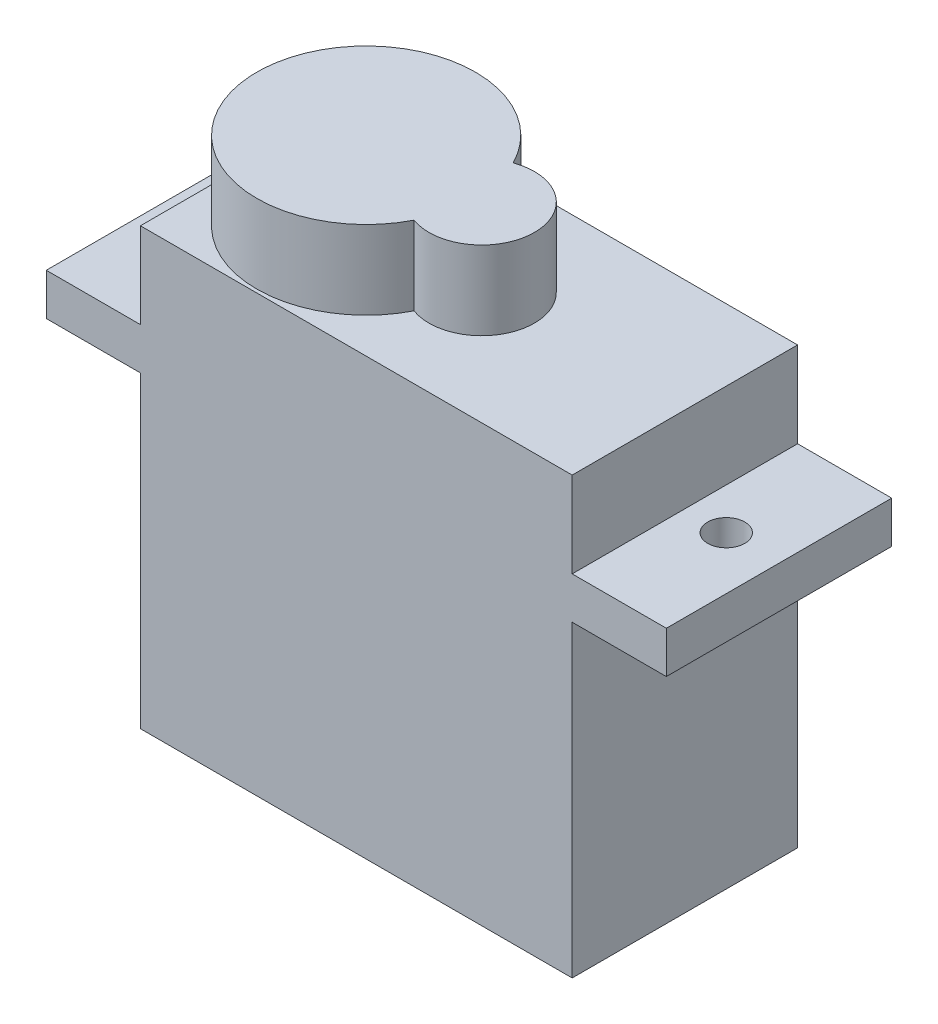
ISO-10303-21;
HEADER;
FILE_DESCRIPTION(('STEP AP214'),'2;1');
FILE_NAME('part.step','',(''),(''),'','','');
FILE_SCHEMA(('AUTOMOTIVE_DESIGN { 1 0 10303 214 1 1 1 1 }'));
ENDSEC;
DATA;
#1=APPLICATION_CONTEXT('core data for automotive mechanical design processes');
#2=APPLICATION_PROTOCOL_DEFINITION('international standard','automotive_design',2000,#1);
#3=PRODUCT_CONTEXT('',#1,'mechanical');
#4=PRODUCT('Part','Part','',(#3));
#5=PRODUCT_RELATED_PRODUCT_CATEGORY('part','',(#4));
#6=PRODUCT_DEFINITION_FORMATION('','',#4);
#7=PRODUCT_DEFINITION_CONTEXT('part definition',#1,'design');
#8=PRODUCT_DEFINITION('design','',#6,#7);
#9=PRODUCT_DEFINITION_SHAPE('','',#8);
#10=(LENGTH_UNIT() NAMED_UNIT(*) SI_UNIT(.MILLI.,.METRE.));
#11=(NAMED_UNIT(*) PLANE_ANGLE_UNIT() SI_UNIT($,.RADIAN.));
#12=(NAMED_UNIT(*) SI_UNIT($,.STERADIAN.) SOLID_ANGLE_UNIT());
#13=UNCERTAINTY_MEASURE_WITH_UNIT(LENGTH_MEASURE(1.E-05),#10,'distance_accuracy_value','');
#14=(GEOMETRIC_REPRESENTATION_CONTEXT(3) GLOBAL_UNCERTAINTY_ASSIGNED_CONTEXT((#13)) GLOBAL_UNIT_ASSIGNED_CONTEXT((#10,
#11,#12)) REPRESENTATION_CONTEXT('',''));
#15=CARTESIAN_POINT('',(0.,0.,0.));
#16=DIRECTION('',(0.,0.,1.));
#17=DIRECTION('',(1.,0.,0.));
#18=AXIS2_PLACEMENT_3D('',#15,#16,#17);
#19=CARTESIAN_POINT('',(0.,6.7,0.));
#20=DIRECTION('',(0.,-1.,0.));
#21=DIRECTION('',(0.,0.,-1.));
#22=AXIS2_PLACEMENT_3D('',#19,#20,#21);
#23=PLANE('',#22);
#24=DIRECTION('',(0.,0.,-1.));
#25=VECTOR('',#24,1.);
#26=CARTESIAN_POINT('',(11.35,6.7,5.925));
#27=LINE('',#26,#25);
#28=CARTESIAN_POINT('',(11.35,6.7,5.925));
#29=VERTEX_POINT('',#28);
#30=CARTESIAN_POINT('',(11.35,6.7,-5.925));
#31=VERTEX_POINT('',#30);
#32=EDGE_CURVE('E168',#29,#31,#27,.T.);
#33=ORIENTED_EDGE('',*,*,#32,.T.);
#34=DIRECTION('',(-1.,0.,0.));
#35=VECTOR('',#34,1.);
#36=CARTESIAN_POINT('',(-11.35,6.7,-5.925));
#37=LINE('',#36,#35);
#38=CARTESIAN_POINT('',(-11.35,6.7,-5.925));
#39=VERTEX_POINT('',#38);
#40=EDGE_CURVE('E171',#31,#39,#37,.T.);
#41=ORIENTED_EDGE('',*,*,#40,.T.);
#42=DIRECTION('',(0.,0.,1.));
#43=VECTOR('',#42,1.);
#44=CARTESIAN_POINT('',(-11.35,6.7,5.925));
#45=LINE('',#44,#43);
#46=CARTESIAN_POINT('',(-11.35,6.7,5.925));
#47=VERTEX_POINT('',#46);
#48=EDGE_CURVE('E174',#39,#47,#45,.T.);
#49=ORIENTED_EDGE('',*,*,#48,.T.);
#50=DIRECTION('',(1.,0.,0.));
#51=VECTOR('',#50,1.);
#52=CARTESIAN_POINT('',(-11.35,6.7,5.925));
#53=LINE('',#52,#51);
#54=EDGE_CURVE('E177',#47,#29,#53,.T.);
#55=ORIENTED_EDGE('',*,*,#54,.T.);
#56=EDGE_LOOP('',(#33,#41,#49,#55));
#57=FACE_BOUND('',#56,.T.);
#58=CARTESIAN_POINT('',(-5.40813132000409,6.7,0.));
#59=DIRECTION('',(0.,1.,0.));
#60=DIRECTION('',(0.,0.,1.));
#61=AXIS2_PLACEMENT_3D('',#58,#59,#60);
#62=CIRCLE('',#61,5.75);
#63=CARTESIAN_POINT('',(-0.283234200662525,6.7,-2.6072839347038));
#64=VERTEX_POINT('',#63);
#65=CARTESIAN_POINT('',(-0.283234200662525,6.7,2.6072839347038));
#66=VERTEX_POINT('',#65);
#67=EDGE_CURVE('E141',#64,#66,#62,.T.);
#68=ORIENTED_EDGE('',*,*,#67,.F.);
#69=CARTESIAN_POINT('',(0.666868679995911,6.7,0.));
#70=DIRECTION('',(0.,1.,0.));
#71=DIRECTION('',(0.,0.,1.));
#72=AXIS2_PLACEMENT_3D('',#69,#70,#71);
#73=CIRCLE('',#72,2.775);
#74=EDGE_CURVE('E57',#66,#64,#73,.T.);
#75=ORIENTED_EDGE('',*,*,#74,.F.);
#76=EDGE_LOOP('',(#68,#75));
#77=FACE_BOUND('',#76,.T.);
#78=ADVANCED_FACE('F41',(#57,#77),#23,.F.);
#79=CARTESIAN_POINT('',(0.,2.2,0.));
#80=DIRECTION('',(0.,-1.,0.));
#81=DIRECTION('',(0.,0.,-1.));
#82=AXIS2_PLACEMENT_3D('',#79,#80,#81);
#83=PLANE('',#82);
#84=DIRECTION('',(1.,0.,0.));
#85=VECTOR('',#84,1.);
#86=CARTESIAN_POINT('',(-16.3,2.2,5.925));
#87=LINE('',#86,#85);
#88=CARTESIAN_POINT('',(-16.3,2.2,5.925));
#89=VERTEX_POINT('',#88);
#90=CARTESIAN_POINT('',(-11.35,2.2,5.925));
#91=VERTEX_POINT('',#90);
#92=EDGE_CURVE('E220',#89,#91,#87,.T.);
#93=ORIENTED_EDGE('',*,*,#92,.T.);
#94=DIRECTION('',(0.,0.,-1.));
#95=VECTOR('',#94,1.);
#96=CARTESIAN_POINT('',(-11.35,2.2,0.));
#97=LINE('',#96,#95);
#98=CARTESIAN_POINT('',(-11.35,2.2,-5.925));
#99=VERTEX_POINT('',#98);
#100=EDGE_CURVE('E196',#91,#99,#97,.T.);
#101=ORIENTED_EDGE('',*,*,#100,.T.);
#102=DIRECTION('',(-1.,0.,0.));
#103=VECTOR('',#102,1.);
#104=CARTESIAN_POINT('',(-16.3,2.2,-5.925));
#105=LINE('',#104,#103);
#106=CARTESIAN_POINT('',(-16.3,2.2,-5.925));
#107=VERTEX_POINT('',#106);
#108=EDGE_CURVE('E213',#99,#107,#105,.T.);
#109=ORIENTED_EDGE('',*,*,#108,.T.);
#110=DIRECTION('',(0.,0.,1.));
#111=VECTOR('',#110,1.);
#112=CARTESIAN_POINT('',(-16.3,2.2,5.925));
#113=LINE('',#112,#111);
#114=EDGE_CURVE('E217',#107,#89,#113,.T.);
#115=ORIENTED_EDGE('',*,*,#114,.T.);
#116=EDGE_LOOP('',(#93,#101,#109,#115));
#117=FACE_BOUND('',#116,.T.);
#118=CARTESIAN_POINT('',(-13.525,2.2,0.));
#119=DIRECTION('',(0.,-1.,0.));
#120=DIRECTION('',(0.,0.,1.));
#121=AXIS2_PLACEMENT_3D('',#118,#119,#120);
#122=CIRCLE('',#121,0.975);
#123=CARTESIAN_POINT('',(-13.525,2.2,0.975));
#124=VERTEX_POINT('',#123);
#125=EDGE_CURVE('E161',#124,#124,#122,.T.);
#126=ORIENTED_EDGE('',*,*,#125,.T.);
#127=EDGE_LOOP('',(#126));
#128=FACE_BOUND('',#127,.T.);
#129=ADVANCED_FACE('F297',(#117,#128),#83,.F.);
#130=CARTESIAN_POINT('',(0.,0.,0.));
#131=DIRECTION('',(0.,-1.,0.));
#132=DIRECTION('',(0.,0.,-1.));
#133=AXIS2_PLACEMENT_3D('',#130,#131,#132);
#134=PLANE('',#133);
#135=DIRECTION('',(0.,0.,-1.));
#136=VECTOR('',#135,1.);
#137=CARTESIAN_POINT('',(-11.35,0.,0.));
#138=LINE('',#137,#136);
#139=CARTESIAN_POINT('',(-11.35,0.,5.925));
#140=VERTEX_POINT('',#139);
#141=CARTESIAN_POINT('',(-11.35,0.,-5.925));
#142=VERTEX_POINT('',#141);
#143=EDGE_CURVE('E50',#140,#142,#138,.T.);
#144=ORIENTED_EDGE('',*,*,#143,.F.);
#145=DIRECTION('',(1.,0.,0.));
#146=VECTOR('',#145,1.);
#147=CARTESIAN_POINT('',(-16.3,0.,5.925));
#148=LINE('',#147,#146);
#149=CARTESIAN_POINT('',(-16.3,0.,5.925));
#150=VERTEX_POINT('',#149);
#151=EDGE_CURVE('E214',#150,#140,#148,.T.);
#152=ORIENTED_EDGE('',*,*,#151,.F.);
#153=DIRECTION('',(0.,0.,1.));
#154=VECTOR('',#153,1.);
#155=CARTESIAN_POINT('',(-16.3,0.,5.925));
#156=LINE('',#155,#154);
#157=CARTESIAN_POINT('',(-16.3,0.,-5.925));
#158=VERTEX_POINT('',#157);
#159=EDGE_CURVE('E229',#158,#150,#156,.T.);
#160=ORIENTED_EDGE('',*,*,#159,.F.);
#161=DIRECTION('',(-1.,0.,0.));
#162=VECTOR('',#161,1.);
#163=CARTESIAN_POINT('',(-16.3,0.,-5.925));
#164=LINE('',#163,#162);
#165=EDGE_CURVE('E225',#142,#158,#164,.T.);
#166=ORIENTED_EDGE('',*,*,#165,.F.);
#167=EDGE_LOOP('',(#144,#152,#160,#166));
#168=FACE_BOUND('',#167,.T.);
#169=CARTESIAN_POINT('',(-13.525,0.,0.));
#170=DIRECTION('',(0.,-1.,0.));
#171=DIRECTION('',(0.,0.,-1.));
#172=AXIS2_PLACEMENT_3D('',#169,#170,#171);
#173=CIRCLE('',#172,0.975);
#174=CARTESIAN_POINT('',(-13.525,0.,-0.975));
#175=VERTEX_POINT('',#174);
#176=EDGE_CURVE('E45',#175,#175,#173,.F.);
#177=ORIENTED_EDGE('',*,*,#176,.T.);
#178=EDGE_LOOP('',(#177));
#179=FACE_BOUND('',#178,.T.);
#180=ADVANCED_FACE('F257',(#168,#179),#134,.T.);
#181=CARTESIAN_POINT('',(13.525,2.2,0.));
#182=DIRECTION('',(0.,1.,0.));
#183=DIRECTION('',(0.,0.,1.));
#184=AXIS2_PLACEMENT_3D('',#181,#182,#183);
#185=CIRCLE('',#184,0.975);
#186=CARTESIAN_POINT('',(13.525,2.2,0.975));
#187=VERTEX_POINT('',#186);
#188=EDGE_CURVE('E164',#187,#187,#185,.T.);
#189=ORIENTED_EDGE('',*,*,#188,.F.);
#190=EDGE_LOOP('',(#189));
#191=FACE_BOUND('',#190,.T.);
#192=CARTESIAN_POINT('',(16.3,2.2,-5.925));
#193=VERTEX_POINT('',#192);
#194=CARTESIAN_POINT('',(11.35,2.2,-5.925));
#195=VERTEX_POINT('',#194);
#196=EDGE_CURVE('E215',#193,#195,#105,.T.);
#197=ORIENTED_EDGE('',*,*,#196,.T.);
#198=DIRECTION('',(0.,0.,1.));
#199=VECTOR('',#198,1.);
#200=CARTESIAN_POINT('',(11.35,2.2,0.));
#201=LINE('',#200,#199);
#202=CARTESIAN_POINT('',(11.35,2.2,5.925));
#203=VERTEX_POINT('',#202);
#204=EDGE_CURVE('E65',#195,#203,#201,.T.);
#205=ORIENTED_EDGE('',*,*,#204,.T.);
#206=CARTESIAN_POINT('',(16.3,2.2,5.925));
#207=VERTEX_POINT('',#206);
#208=EDGE_CURVE('E219',#203,#207,#87,.T.);
#209=ORIENTED_EDGE('',*,*,#208,.T.);
#210=DIRECTION('',(0.,0.,-1.));
#211=VECTOR('',#210,1.);
#212=CARTESIAN_POINT('',(16.3,2.2,5.925));
#213=LINE('',#212,#211);
#214=EDGE_CURVE('E210',#207,#193,#213,.T.);
#215=ORIENTED_EDGE('',*,*,#214,.T.);
#216=EDGE_LOOP('',(#197,#205,#209,#215));
#217=FACE_BOUND('',#216,.T.);
#218=ADVANCED_FACE('F255',(#191,#217),#83,.F.);
#219=CARTESIAN_POINT('',(13.525,0.,0.));
#220=DIRECTION('',(0.,-1.,0.));
#221=DIRECTION('',(0.,0.,-1.));
#222=AXIS2_PLACEMENT_3D('',#219,#220,#221);
#223=CIRCLE('',#222,0.975);
#224=CARTESIAN_POINT('',(13.525,0.,-0.975));
#225=VERTEX_POINT('',#224);
#226=EDGE_CURVE('E167',#225,#225,#223,.T.);
#227=ORIENTED_EDGE('',*,*,#226,.F.);
#228=EDGE_LOOP('',(#227));
#229=FACE_BOUND('',#228,.T.);
#230=DIRECTION('',(0.,0.,1.));
#231=VECTOR('',#230,1.);
#232=CARTESIAN_POINT('',(11.35,0.,0.));
#233=LINE('',#232,#231);
#234=CARTESIAN_POINT('',(11.35,0.,-5.925));
#235=VERTEX_POINT('',#234);
#236=CARTESIAN_POINT('',(11.35,0.,5.925));
#237=VERTEX_POINT('',#236);
#238=EDGE_CURVE('E12',#235,#237,#233,.T.);
#239=ORIENTED_EDGE('',*,*,#238,.F.);
#240=CARTESIAN_POINT('',(16.3,0.,-5.925));
#241=VERTEX_POINT('',#240);
#242=EDGE_CURVE('E226',#241,#235,#164,.T.);
#243=ORIENTED_EDGE('',*,*,#242,.F.);
#244=DIRECTION('',(0.,0.,-1.));
#245=VECTOR('',#244,1.);
#246=CARTESIAN_POINT('',(16.3,0.,5.925));
#247=LINE('',#246,#245);
#248=CARTESIAN_POINT('',(16.3,0.,5.925));
#249=VERTEX_POINT('',#248);
#250=EDGE_CURVE('E209',#249,#241,#247,.T.);
#251=ORIENTED_EDGE('',*,*,#250,.F.);
#252=EDGE_CURVE('E231',#237,#249,#148,.T.);
#253=ORIENTED_EDGE('',*,*,#252,.F.);
#254=EDGE_LOOP('',(#239,#243,#251,#253));
#255=FACE_BOUND('',#254,.T.);
#256=ADVANCED_FACE('F252',(#229,#255),#134,.T.);
#257=CARTESIAN_POINT('',(16.3,2.2,5.925));
#258=DIRECTION('',(-1.,0.,0.));
#259=DIRECTION('',(0.,0.,1.));
#260=AXIS2_PLACEMENT_3D('',#257,#258,#259);
#261=PLANE('',#260);
#262=ORIENTED_EDGE('',*,*,#250,.T.);
#263=DIRECTION('',(0.,-1.,0.));
#264=VECTOR('',#263,1.);
#265=CARTESIAN_POINT('',(16.3,2.2,-5.925));
#266=LINE('',#265,#264);
#267=EDGE_CURVE('E242',#193,#241,#266,.T.);
#268=ORIENTED_EDGE('',*,*,#267,.F.);
#269=ORIENTED_EDGE('',*,*,#214,.F.);
#270=DIRECTION('',(0.,-1.,0.));
#271=VECTOR('',#270,1.);
#272=CARTESIAN_POINT('',(16.3,2.2,5.925));
#273=LINE('',#272,#271);
#274=EDGE_CURVE('E222',#207,#249,#273,.T.);
#275=ORIENTED_EDGE('',*,*,#274,.T.);
#276=EDGE_LOOP('',(#262,#268,#269,#275));
#277=FACE_BOUND('',#276,.T.);
#278=ADVANCED_FACE('F43',(#277),#261,.F.);
#279=CARTESIAN_POINT('',(-16.3,2.2,-5.925));
#280=DIRECTION('',(0.,0.,1.));
#281=DIRECTION('',(1.,0.,0.));
#282=AXIS2_PLACEMENT_3D('',#279,#280,#281);
#283=PLANE('',#282);
#284=ORIENTED_EDGE('',*,*,#108,.F.);
#285=DIRECTION('',(0.,1.,0.));
#286=VECTOR('',#285,1.);
#287=CARTESIAN_POINT('',(-11.35,-16.2,-5.925));
#288=LINE('',#287,#286);
#289=EDGE_CURVE('E203',#99,#39,#288,.T.);
#290=ORIENTED_EDGE('',*,*,#289,.T.);
#291=ORIENTED_EDGE('',*,*,#40,.F.);
#292=DIRECTION('',(0.,1.,0.));
#293=VECTOR('',#292,1.);
#294=CARTESIAN_POINT('',(11.35,-16.2,-5.925));
#295=LINE('',#294,#293);
#296=EDGE_CURVE('E192',#195,#31,#295,.T.);
#297=ORIENTED_EDGE('',*,*,#296,.F.);
#298=ORIENTED_EDGE('',*,*,#196,.F.);
#299=ORIENTED_EDGE('',*,*,#267,.T.);
#300=ORIENTED_EDGE('',*,*,#242,.T.);
#301=CARTESIAN_POINT('',(11.35,-16.2,-5.925));
#302=VERTEX_POINT('',#301);
#303=EDGE_CURVE('E204',#302,#235,#295,.T.);
#304=ORIENTED_EDGE('',*,*,#303,.F.);
#305=DIRECTION('',(-1.,0.,0.));
#306=VECTOR('',#305,1.);
#307=CARTESIAN_POINT('',(-11.35,-16.2,-5.925));
#308=LINE('',#307,#306);
#309=CARTESIAN_POINT('',(-11.35,-16.2,-5.925));
#310=VERTEX_POINT('',#309);
#311=EDGE_CURVE('E183',#302,#310,#308,.T.);
#312=ORIENTED_EDGE('',*,*,#311,.T.);
#313=EDGE_CURVE('E201',#310,#142,#288,.T.);
#314=ORIENTED_EDGE('',*,*,#313,.T.);
#315=ORIENTED_EDGE('',*,*,#165,.T.);
#316=DIRECTION('',(0.,-1.,0.));
#317=VECTOR('',#316,1.);
#318=CARTESIAN_POINT('',(-16.3,2.2,-5.925));
#319=LINE('',#318,#317);
#320=EDGE_CURVE('E239',#107,#158,#319,.T.);
#321=ORIENTED_EDGE('',*,*,#320,.F.);
#322=EDGE_LOOP('',(#284,#290,#291,#297,#298,#299,#300,#304,#312,#314,#315,#321));
#323=FACE_BOUND('',#322,.T.);
#324=ADVANCED_FACE('F263',(#323),#283,.F.);
#325=CARTESIAN_POINT('',(-16.3,2.2,5.925));
#326=DIRECTION('',(1.,0.,0.));
#327=DIRECTION('',(0.,0.,-1.));
#328=AXIS2_PLACEMENT_3D('',#325,#326,#327);
#329=PLANE('',#328);
#330=ORIENTED_EDGE('',*,*,#159,.T.);
#331=DIRECTION('',(0.,-1.,0.));
#332=VECTOR('',#331,1.);
#333=CARTESIAN_POINT('',(-16.3,2.2,5.925));
#334=LINE('',#333,#332);
#335=EDGE_CURVE('E236',#89,#150,#334,.T.);
#336=ORIENTED_EDGE('',*,*,#335,.F.);
#337=ORIENTED_EDGE('',*,*,#114,.F.);
#338=ORIENTED_EDGE('',*,*,#320,.T.);
#339=EDGE_LOOP('',(#330,#336,#337,#338));
#340=FACE_BOUND('',#339,.T.);
#341=ADVANCED_FACE('F290',(#340),#329,.F.);
#342=CARTESIAN_POINT('',(-16.3,2.2,5.925));
#343=DIRECTION('',(0.,0.,-1.));
#344=DIRECTION('',(-1.,0.,0.));
#345=AXIS2_PLACEMENT_3D('',#342,#343,#344);
#346=PLANE('',#345);
#347=ORIENTED_EDGE('',*,*,#151,.T.);
#348=DIRECTION('',(0.,1.,0.));
#349=VECTOR('',#348,1.);
#350=CARTESIAN_POINT('',(-11.35,-16.2,5.925));
#351=LINE('',#350,#349);
#352=CARTESIAN_POINT('',(-11.35,-16.2,5.925));
#353=VERTEX_POINT('',#352);
#354=EDGE_CURVE('E198',#353,#140,#351,.T.);
#355=ORIENTED_EDGE('',*,*,#354,.F.);
#356=DIRECTION('',(1.,0.,0.));
#357=VECTOR('',#356,1.);
#358=CARTESIAN_POINT('',(-11.35,-16.2,5.925));
#359=LINE('',#358,#357);
#360=CARTESIAN_POINT('',(11.35,-16.2,5.925));
#361=VERTEX_POINT('',#360);
#362=EDGE_CURVE('E189',#353,#361,#359,.T.);
#363=ORIENTED_EDGE('',*,*,#362,.T.);
#364=DIRECTION('',(0.,1.,0.));
#365=VECTOR('',#364,1.);
#366=CARTESIAN_POINT('',(11.35,-16.2,5.925));
#367=LINE('',#366,#365);
#368=EDGE_CURVE('E193',#361,#237,#367,.T.);
#369=ORIENTED_EDGE('',*,*,#368,.T.);
#370=ORIENTED_EDGE('',*,*,#252,.T.);
#371=ORIENTED_EDGE('',*,*,#274,.F.);
#372=ORIENTED_EDGE('',*,*,#208,.F.);
#373=EDGE_CURVE('E197',#203,#29,#367,.T.);
#374=ORIENTED_EDGE('',*,*,#373,.T.);
#375=ORIENTED_EDGE('',*,*,#54,.F.);
#376=EDGE_CURVE('E200',#91,#47,#351,.T.);
#377=ORIENTED_EDGE('',*,*,#376,.F.);
#378=ORIENTED_EDGE('',*,*,#92,.F.);
#379=ORIENTED_EDGE('',*,*,#335,.T.);
#380=EDGE_LOOP('',(#347,#355,#363,#369,#370,#371,#372,#374,#375,#377,#378,#379));
#381=FACE_BOUND('',#380,.T.);
#382=ADVANCED_FACE('F271',(#381),#346,.F.);
#383=CARTESIAN_POINT('',(0.,-16.2,0.));
#384=DIRECTION('',(0.,-1.,0.));
#385=DIRECTION('',(0.,0.,-1.));
#386=AXIS2_PLACEMENT_3D('',#383,#384,#385);
#387=PLANE('',#386);
#388=DIRECTION('',(0.,0.,-1.));
#389=VECTOR('',#388,1.);
#390=CARTESIAN_POINT('',(11.35,-16.2,5.925));
#391=LINE('',#390,#389);
#392=EDGE_CURVE('E180',#361,#302,#391,.T.);
#393=ORIENTED_EDGE('',*,*,#392,.F.);
#394=ORIENTED_EDGE('',*,*,#362,.F.);
#395=DIRECTION('',(0.,0.,1.));
#396=VECTOR('',#395,1.);
#397=CARTESIAN_POINT('',(-11.35,-16.2,5.925));
#398=LINE('',#397,#396);
#399=EDGE_CURVE('E186',#310,#353,#398,.T.);
#400=ORIENTED_EDGE('',*,*,#399,.F.);
#401=ORIENTED_EDGE('',*,*,#311,.F.);
#402=EDGE_LOOP('',(#393,#394,#400,#401));
#403=FACE_BOUND('',#402,.T.);
#404=ADVANCED_FACE('F277',(#403),#387,.T.);
#405=CARTESIAN_POINT('',(-11.35,-16.2,5.925));
#406=DIRECTION('',(-1.,0.,0.));
#407=DIRECTION('',(0.,0.,1.));
#408=AXIS2_PLACEMENT_3D('',#405,#406,#407);
#409=PLANE('',#408);
#410=ORIENTED_EDGE('',*,*,#354,.T.);
#411=ORIENTED_EDGE('',*,*,#143,.T.);
#412=ORIENTED_EDGE('',*,*,#313,.F.);
#413=ORIENTED_EDGE('',*,*,#399,.T.);
#414=EDGE_LOOP('',(#410,#411,#412,#413));
#415=FACE_BOUND('',#414,.T.);
#416=ADVANCED_FACE('F283',(#415),#409,.T.);
#417=CARTESIAN_POINT('',(11.35,-16.2,5.925));
#418=DIRECTION('',(1.,0.,0.));
#419=DIRECTION('',(0.,0.,-1.));
#420=AXIS2_PLACEMENT_3D('',#417,#418,#419);
#421=PLANE('',#420);
#422=ORIENTED_EDGE('',*,*,#303,.T.);
#423=ORIENTED_EDGE('',*,*,#238,.T.);
#424=ORIENTED_EDGE('',*,*,#368,.F.);
#425=ORIENTED_EDGE('',*,*,#392,.T.);
#426=EDGE_LOOP('',(#422,#423,#424,#425));
#427=FACE_BOUND('',#426,.T.);
#428=ADVANCED_FACE('F275',(#427),#421,.T.);
#429=ORIENTED_EDGE('',*,*,#204,.F.);
#430=ORIENTED_EDGE('',*,*,#296,.T.);
#431=ORIENTED_EDGE('',*,*,#32,.F.);
#432=ORIENTED_EDGE('',*,*,#373,.F.);
#433=EDGE_LOOP('',(#429,#430,#431,#432));
#434=FACE_BOUND('',#433,.T.);
#435=ADVANCED_FACE('F307',(#434),#421,.T.);
#436=ORIENTED_EDGE('',*,*,#100,.F.);
#437=ORIENTED_EDGE('',*,*,#376,.T.);
#438=ORIENTED_EDGE('',*,*,#48,.F.);
#439=ORIENTED_EDGE('',*,*,#289,.F.);
#440=EDGE_LOOP('',(#436,#437,#438,#439));
#441=FACE_BOUND('',#440,.T.);
#442=ADVANCED_FACE('F301',(#441),#409,.T.);
#443=CARTESIAN_POINT('',(13.525,-2.3,0.));
#444=DIRECTION('',(0.,1.,0.));
#445=DIRECTION('',(0.,0.,1.));
#446=AXIS2_PLACEMENT_3D('',#443,#444,#445);
#447=CYLINDRICAL_SURFACE('',#446,0.975);
#448=ORIENTED_EDGE('',*,*,#226,.T.);
#449=EDGE_LOOP('',(#448));
#450=FACE_BOUND('',#449,.T.);
#451=ORIENTED_EDGE('',*,*,#188,.T.);
#452=EDGE_LOOP('',(#451));
#453=FACE_BOUND('',#452,.T.);
#454=ADVANCED_FACE('F249',(#450,#453),#447,.F.);
#455=CARTESIAN_POINT('',(-13.525,-2.3,0.));
#456=DIRECTION('',(0.,1.,0.));
#457=DIRECTION('',(0.,0.,1.));
#458=AXIS2_PLACEMENT_3D('',#455,#456,#457);
#459=CYLINDRICAL_SURFACE('',#458,0.975);
#460=ORIENTED_EDGE('',*,*,#176,.F.);
#461=EDGE_LOOP('',(#460));
#462=FACE_BOUND('',#461,.T.);
#463=ORIENTED_EDGE('',*,*,#125,.F.);
#464=EDGE_LOOP('',(#463));
#465=FACE_BOUND('',#464,.T.);
#466=ADVANCED_FACE('F372',(#462,#465),#459,.F.);
#467=CARTESIAN_POINT('',(-5.40813132000409,10.83,0.));
#468=DIRECTION('',(0.,1.,0.));
#469=DIRECTION('',(0.,0.,1.));
#470=AXIS2_PLACEMENT_3D('',#467,#468,#469);
#471=PLANE('',#470);
#472=CARTESIAN_POINT('',(-5.40813132000409,10.83,0.));
#473=DIRECTION('',(0.,1.,0.));
#474=DIRECTION('',(0.,0.,1.));
#475=AXIS2_PLACEMENT_3D('',#472,#473,#474);
#476=CIRCLE('',#475,5.75);
#477=CARTESIAN_POINT('',(-0.283234200662525,10.83,-2.6072839347038));
#478=VERTEX_POINT('',#477);
#479=CARTESIAN_POINT('',(-0.283234200662525,10.83,2.6072839347038));
#480=VERTEX_POINT('',#479);
#481=EDGE_CURVE('E144',#478,#480,#476,.T.);
#482=ORIENTED_EDGE('',*,*,#481,.T.);
#483=CARTESIAN_POINT('',(0.666868679995911,10.83,0.));
#484=DIRECTION('',(0.,1.,0.));
#485=DIRECTION('',(0.,0.,1.));
#486=AXIS2_PLACEMENT_3D('',#483,#484,#485);
#487=CIRCLE('',#486,2.775);
#488=EDGE_CURVE('E145',#480,#478,#487,.T.);
#489=ORIENTED_EDGE('',*,*,#488,.T.);
#490=EDGE_LOOP('',(#482,#489));
#491=FACE_BOUND('',#490,.T.);
#492=ADVANCED_FACE('F391',(#491),#471,.T.);
#493=CARTESIAN_POINT('',(-5.40813132000409,10.83,0.));
#494=DIRECTION('',(0.,-1.,0.));
#495=DIRECTION('',(0.,0.,-1.));
#496=AXIS2_PLACEMENT_3D('',#493,#494,#495);
#497=CYLINDRICAL_SURFACE('',#496,5.75);
#498=DIRECTION('',(0.,-1.,0.));
#499=VECTOR('',#498,1.);
#500=CARTESIAN_POINT('',(-0.283234200662525,8.765,2.6072839347038));
#501=LINE('',#500,#499);
#502=EDGE_CURVE('E154',#480,#66,#501,.T.);
#503=ORIENTED_EDGE('',*,*,#502,.F.);
#504=ORIENTED_EDGE('',*,*,#481,.F.);
#505=DIRECTION('',(0.,-1.,0.));
#506=VECTOR('',#505,1.);
#507=CARTESIAN_POINT('',(-0.283234200662525,8.765,-2.6072839347038));
#508=LINE('',#507,#506);
#509=EDGE_CURVE('E148',#64,#478,#508,.F.);
#510=ORIENTED_EDGE('',*,*,#509,.F.);
#511=ORIENTED_EDGE('',*,*,#67,.T.);
#512=EDGE_LOOP('',(#503,#504,#510,#511));
#513=FACE_BOUND('',#512,.T.);
#514=ADVANCED_FACE('F149',(#513),#497,.T.);
#515=CARTESIAN_POINT('',(0.666868679995911,10.83,0.));
#516=DIRECTION('',(0.,-1.,0.));
#517=DIRECTION('',(0.,0.,-1.));
#518=AXIS2_PLACEMENT_3D('',#515,#516,#517);
#519=CYLINDRICAL_SURFACE('',#518,2.775);
#520=ORIENTED_EDGE('',*,*,#488,.F.);
#521=ORIENTED_EDGE('',*,*,#502,.T.);
#522=ORIENTED_EDGE('',*,*,#74,.T.);
#523=ORIENTED_EDGE('',*,*,#509,.T.);
#524=EDGE_LOOP('',(#520,#521,#522,#523));
#525=FACE_BOUND('',#524,.T.);
#526=ADVANCED_FACE('F156',(#525),#519,.T.);
#527=CLOSED_SHELL('',(#78,#129,#180,#218,#256,#278,#324,#341,#382,#404,#416,#428,#435,#442,#454,
#466,#492,#514,#526));
#528=MANIFOLD_SOLID_BREP('B2',#527);
#529=ADVANCED_BREP_SHAPE_REPRESENTATION('',(#18,#528),#14);
#530=SHAPE_DEFINITION_REPRESENTATION(#9,#529);
ENDSEC;
END-ISO-10303-21;
